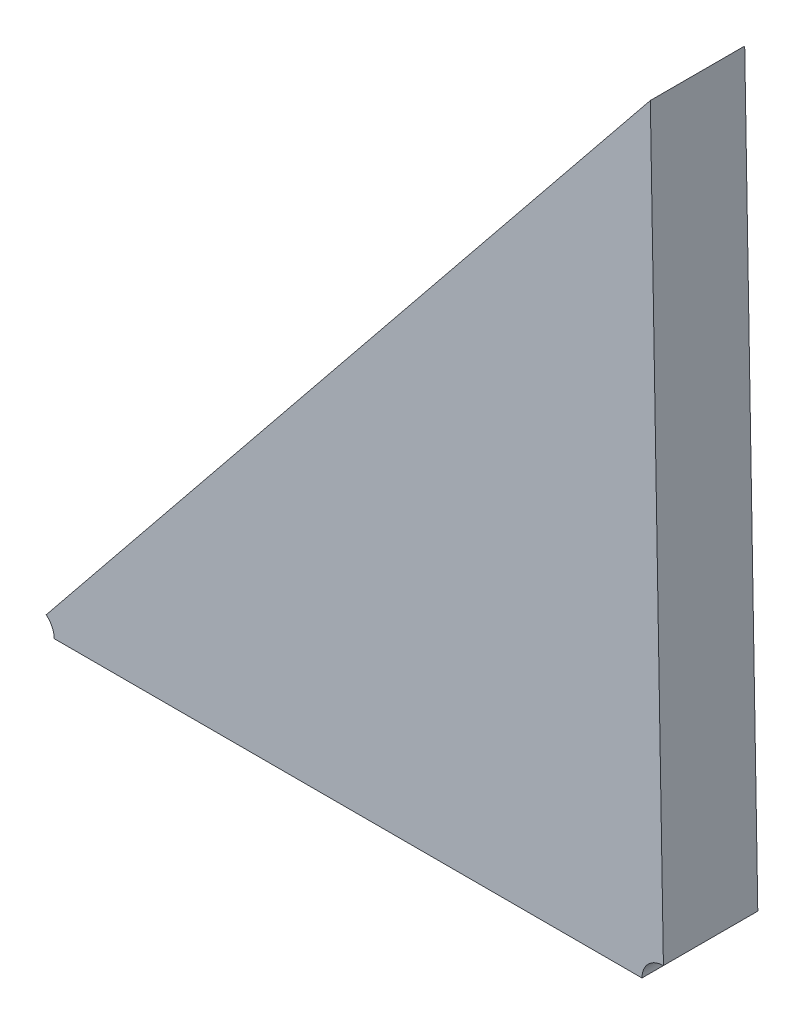
ISO-10303-21;
HEADER;
FILE_DESCRIPTION(('STEP AP214'),'2;1');
FILE_NAME('part.step','',(''),(''),'','','');
FILE_SCHEMA(('AUTOMOTIVE_DESIGN { 1 0 10303 214 1 1 1 1 }'));
ENDSEC;
DATA;
#1=APPLICATION_CONTEXT('core data for automotive mechanical design processes');
#2=APPLICATION_PROTOCOL_DEFINITION('international standard','automotive_design',2000,#1);
#3=PRODUCT_CONTEXT('',#1,'mechanical');
#4=PRODUCT('Part','Part','',(#3));
#5=PRODUCT_RELATED_PRODUCT_CATEGORY('part','',(#4));
#6=PRODUCT_DEFINITION_FORMATION('','',#4);
#7=PRODUCT_DEFINITION_CONTEXT('part definition',#1,'design');
#8=PRODUCT_DEFINITION('design','',#6,#7);
#9=PRODUCT_DEFINITION_SHAPE('','',#8);
#10=(LENGTH_UNIT() NAMED_UNIT(*) SI_UNIT(.MILLI.,.METRE.));
#11=(NAMED_UNIT(*) PLANE_ANGLE_UNIT() SI_UNIT($,.RADIAN.));
#12=(NAMED_UNIT(*) SI_UNIT($,.STERADIAN.) SOLID_ANGLE_UNIT());
#13=UNCERTAINTY_MEASURE_WITH_UNIT(LENGTH_MEASURE(1.E-05),#10,'distance_accuracy_value','');
#14=(GEOMETRIC_REPRESENTATION_CONTEXT(3) GLOBAL_UNCERTAINTY_ASSIGNED_CONTEXT((#13)) GLOBAL_UNIT_ASSIGNED_CONTEXT((#10,
#11,#12)) REPRESENTATION_CONTEXT('',''));
#15=CARTESIAN_POINT('',(0.,0.,0.));
#16=DIRECTION('',(0.,0.,1.));
#17=DIRECTION('',(1.,0.,0.));
#18=AXIS2_PLACEMENT_3D('',#15,#16,#17);
#19=CARTESIAN_POINT('',(-1.3625891330916,-1.344803661066,0.00415));
#20=DIRECTION('',(0.,0.,1.));
#21=DIRECTION('',(1.,0.,0.));
#22=AXIS2_PLACEMENT_3D('',#19,#20,#21);
#23=PLANE('',#22);
#24=DIRECTION('',(-0.62828920845021,-0.777979865128275,0.));
#25=VECTOR('',#24,1.);
#26=CARTESIAN_POINT('',(-1.3556166200176,-1.3281364525958,0.00415));
#27=LINE('',#26,#25);
#28=CARTESIAN_POINT('',(-1.3556031579694,-1.3281412097136,0.00415));
#29=VERTEX_POINT('',#28);
#30=CARTESIAN_POINT('',(-1.3767269001058,-1.3542762822077,0.00415));
#31=VERTEX_POINT('',#30);
#32=EDGE_CURVE('E11',#29,#31,#27,.T.);
#33=ORIENTED_EDGE('',*,*,#32,.T.);
#34=CARTESIAN_POINT('',(-1.3771981170122,-1.3548597671065,0.00415));
#35=DIRECTION('',(0.,0.,-1.));
#36=DIRECTION('',(-1.,0.,0.));
#37=AXIS2_PLACEMENT_3D('',#34,#35,#36);
#38=CIRCLE('',#37,0.000749999999999991);
#39=CARTESIAN_POINT('',(-1.3764481170122,-1.3548597671065,0.00415));
#40=VERTEX_POINT('',#39);
#41=EDGE_CURVE('E24',#31,#40,#38,.T.);
#42=ORIENTED_EDGE('',*,*,#41,.T.);
#43=DIRECTION('',(1.,0.,0.));
#44=VECTOR('',#43,1.);
#45=CARTESIAN_POINT('',(-1.3764481170122,-1.3548597671065,0.00415));
#46=LINE('',#45,#44);
#47=CARTESIAN_POINT('',(-1.3558954031113,-1.3548597671065,0.00415));
#48=VERTEX_POINT('',#47);
#49=EDGE_CURVE('E110',#40,#48,#46,.T.);
#50=ORIENTED_EDGE('',*,*,#49,.T.);
#51=CARTESIAN_POINT('',(-1.3551454031113,-1.3548597671065,0.00415));
#52=DIRECTION('',(0.,0.,-1.));
#53=DIRECTION('',(0.,-1.,0.));
#54=AXIS2_PLACEMENT_3D('',#51,#52,#53);
#55=CIRCLE('',#54,0.000749999999999999);
#56=CARTESIAN_POINT('',(-1.3551454031113,-1.3541097671065,0.00415));
#57=VERTEX_POINT('',#56);
#58=EDGE_CURVE('E108',#48,#57,#55,.T.);
#59=ORIENTED_EDGE('',*,*,#58,.T.);
#60=DIRECTION('',(0.,1.,0.));
#61=VECTOR('',#60,1.);
#62=CARTESIAN_POINT('',(-1.3551454031113,-1.3541097671065,0.00415));
#63=LINE('',#62,#61);
#64=EDGE_CURVE('E104',#57,#29,#63,.T.);
#65=ORIENTED_EDGE('',*,*,#64,.T.);
#66=EDGE_LOOP('',(#33,#42,#50,#59,#65));
#67=FACE_BOUND('',#66,.T.);
#68=ADVANCED_FACE('F17',(#67),#23,.T.);
#69=CARTESIAN_POINT('',(-1.3771981170122,-1.3548597671065,0.00115));
#70=DIRECTION('',(0.,0.,1.));
#71=DIRECTION('',(-1.,0.,0.));
#72=AXIS2_PLACEMENT_3D('',#69,#70,#71);
#73=CYLINDRICAL_SURFACE('',#72,0.000749999999999991);
#74=DIRECTION('',(0.,0.,1.));
#75=VECTOR('',#74,1.);
#76=CARTESIAN_POINT('',(-1.3767269001058,-1.3542762822077,0.00115));
#77=LINE('',#76,#75);
#78=CARTESIAN_POINT('',(-1.3767269001058,-1.3542762822077,0.00085));
#79=VERTEX_POINT('',#78);
#80=EDGE_CURVE('E102',#79,#31,#77,.T.);
#81=ORIENTED_EDGE('',*,*,#80,.F.);
#82=CARTESIAN_POINT('',(-1.3771981170122,-1.3548597671065,0.00085));
#83=DIRECTION('',(0.,0.,1.));
#84=DIRECTION('',(-1.,0.,0.));
#85=AXIS2_PLACEMENT_3D('',#82,#83,#84);
#86=CIRCLE('',#85,0.000749999999999991);
#87=CARTESIAN_POINT('',(-1.3764481170122,-1.3548597671065,0.00085));
#88=VERTEX_POINT('',#87);
#89=EDGE_CURVE('E77',#88,#79,#86,.T.);
#90=ORIENTED_EDGE('',*,*,#89,.F.);
#91=DIRECTION('',(0.,0.,1.));
#92=VECTOR('',#91,1.);
#93=CARTESIAN_POINT('',(-1.3764481170122,-1.3548597671065,0.00115));
#94=LINE('',#93,#92);
#95=EDGE_CURVE('E98',#88,#40,#94,.T.);
#96=ORIENTED_EDGE('',*,*,#95,.T.);
#97=ORIENTED_EDGE('',*,*,#41,.F.);
#98=EDGE_LOOP('',(#81,#90,#96,#97));
#99=FACE_BOUND('',#98,.T.);
#100=ADVANCED_FACE('F120',(#99),#73,.F.);
#101=CARTESIAN_POINT('',(-1.3551454031113,-1.3548597671065,0.00115));
#102=DIRECTION('',(0.,0.,1.));
#103=DIRECTION('',(-1.,0.,0.));
#104=AXIS2_PLACEMENT_3D('',#101,#102,#103);
#105=CYLINDRICAL_SURFACE('',#104,0.000749999999999999);
#106=DIRECTION('',(0.,0.,-1.));
#107=VECTOR('',#106,1.);
#108=CARTESIAN_POINT('',(-1.3551454031113,-1.3541097671065,0.00115));
#109=LINE('',#108,#107);
#110=CARTESIAN_POINT('',(-1.3551454031113,-1.3541097671065,0.00085));
#111=VERTEX_POINT('',#110);
#112=EDGE_CURVE('E68',#57,#111,#109,.T.);
#113=ORIENTED_EDGE('',*,*,#112,.F.);
#114=ORIENTED_EDGE('',*,*,#58,.F.);
#115=DIRECTION('',(0.,0.,1.));
#116=VECTOR('',#115,1.);
#117=CARTESIAN_POINT('',(-1.3558954031113,-1.3548597671065,0.00115));
#118=LINE('',#117,#116);
#119=CARTESIAN_POINT('',(-1.3558954031113,-1.3548597671065,0.00085));
#120=VERTEX_POINT('',#119);
#121=EDGE_CURVE('E94',#120,#48,#118,.T.);
#122=ORIENTED_EDGE('',*,*,#121,.F.);
#123=CARTESIAN_POINT('',(-1.3551454031113,-1.3548597671065,0.00085));
#124=DIRECTION('',(0.,0.,1.));
#125=DIRECTION('',(-1.,0.,0.));
#126=AXIS2_PLACEMENT_3D('',#123,#124,#125);
#127=CIRCLE('',#126,0.000749999999999999);
#128=EDGE_CURVE('E92',#111,#120,#127,.T.);
#129=ORIENTED_EDGE('',*,*,#128,.F.);
#130=EDGE_LOOP('',(#113,#114,#122,#129));
#131=FACE_BOUND('',#130,.T.);
#132=ADVANCED_FACE('F122',(#131),#105,.F.);
#133=CARTESIAN_POINT('',(-1.3551454031113,-1.3548597671065,0.00085));
#134=DIRECTION('',(0.,1.,0.));
#135=DIRECTION('',(-1.,0.,0.));
#136=AXIS2_PLACEMENT_3D('',#133,#134,#135);
#137=PLANE('',#136);
#138=ORIENTED_EDGE('',*,*,#95,.F.);
#139=DIRECTION('',(-1.,0.,0.));
#140=VECTOR('',#139,1.);
#141=CARTESIAN_POINT('',(-1.3551454031113,-1.3548597671065,0.00085));
#142=LINE('',#141,#140);
#143=EDGE_CURVE('E70',#120,#88,#142,.T.);
#144=ORIENTED_EDGE('',*,*,#143,.F.);
#145=ORIENTED_EDGE('',*,*,#121,.T.);
#146=ORIENTED_EDGE('',*,*,#49,.F.);
#147=EDGE_LOOP('',(#138,#144,#145,#146));
#148=FACE_BOUND('',#147,.T.);
#149=ADVANCED_FACE('F117',(#148),#137,.F.);
#150=CARTESIAN_POINT('',(-1.3626067873048,-1.3447713401587,0.00085));
#151=DIRECTION('',(0.,0.,-1.));
#152=DIRECTION('',(-1.,0.,0.));
#153=AXIS2_PLACEMENT_3D('',#150,#151,#152);
#154=PLANE('',#153);
#155=DIRECTION('',(0.,-1.,0.));
#156=VECTOR('',#155,1.);
#157=CARTESIAN_POINT('',(-1.3551454031113,-1.327552967697,0.00085));
#158=LINE('',#157,#156);
#159=CARTESIAN_POINT('',(-1.3556031579694,-1.3281412097136,0.00085));
#160=VERTEX_POINT('',#159);
#161=EDGE_CURVE('E61',#160,#111,#158,.T.);
#162=ORIENTED_EDGE('',*,*,#161,.T.);
#163=ORIENTED_EDGE('',*,*,#128,.T.);
#164=ORIENTED_EDGE('',*,*,#143,.T.);
#165=ORIENTED_EDGE('',*,*,#89,.T.);
#166=DIRECTION('',(0.628289208450209,0.777979865128275,0.));
#167=VECTOR('',#166,1.);
#168=CARTESIAN_POINT('',(-1.3771981170122,-1.3548597671065,0.00085));
#169=LINE('',#168,#167);
#170=EDGE_CURVE('E71',#79,#160,#169,.T.);
#171=ORIENTED_EDGE('',*,*,#170,.T.);
#172=EDGE_LOOP('',(#162,#163,#164,#165,#171));
#173=FACE_BOUND('',#172,.T.);
#174=ADVANCED_FACE('F74',(#173),#154,.T.);
#175=CARTESIAN_POINT('',(-1.3551454031113,-1.327552967697,0.00085));
#176=DIRECTION('',(-1.,0.,0.));
#177=DIRECTION('',(0.,-1.,0.));
#178=AXIS2_PLACEMENT_3D('',#175,#176,#177);
#179=PLANE('',#178);
#180=ORIENTED_EDGE('',*,*,#112,.T.);
#181=ORIENTED_EDGE('',*,*,#161,.F.);
#182=CARTESIAN_POINT('',(-1.35561662001761,-1.32813645259576,0.00415));
#183=DIRECTION('',(0.,0.,-1.));
#184=VECTOR('',#183,1.);
#185=LINE('',#182,#184);
#186=EDGE_CURVE('E65',#29,#160,#185,.T.);
#187=ORIENTED_EDGE('',*,*,#186,.F.);
#188=ORIENTED_EDGE('',*,*,#64,.F.);
#189=EDGE_LOOP('',(#180,#181,#187,#188));
#190=FACE_BOUND('',#189,.T.);
#191=ADVANCED_FACE('F63',(#190),#179,.F.);
#192=CARTESIAN_POINT('',(-1.3771981170122,-1.3548597671065,0.00085));
#193=DIRECTION('',(0.777979865128275,-0.628289208450209,0.));
#194=DIRECTION('',(0.628289208450209,0.777979865128275,0.));
#195=AXIS2_PLACEMENT_3D('',#192,#193,#194);
#196=PLANE('',#195);
#197=ORIENTED_EDGE('',*,*,#80,.T.);
#198=ORIENTED_EDGE('',*,*,#32,.F.);
#199=ORIENTED_EDGE('',*,*,#186,.T.);
#200=ORIENTED_EDGE('',*,*,#170,.F.);
#201=EDGE_LOOP('',(#197,#198,#199,#200));
#202=FACE_BOUND('',#201,.T.);
#203=ADVANCED_FACE('F81',(#202),#196,.F.);
#204=CLOSED_SHELL('',(#68,#100,#132,#149,#174,#191,#203));
#205=MANIFOLD_SOLID_BREP('B1',#204);
#206=ADVANCED_BREP_SHAPE_REPRESENTATION('',(#18,#205),#14);
#207=SHAPE_DEFINITION_REPRESENTATION(#9,#206);
ENDSEC;
END-ISO-10303-21;
